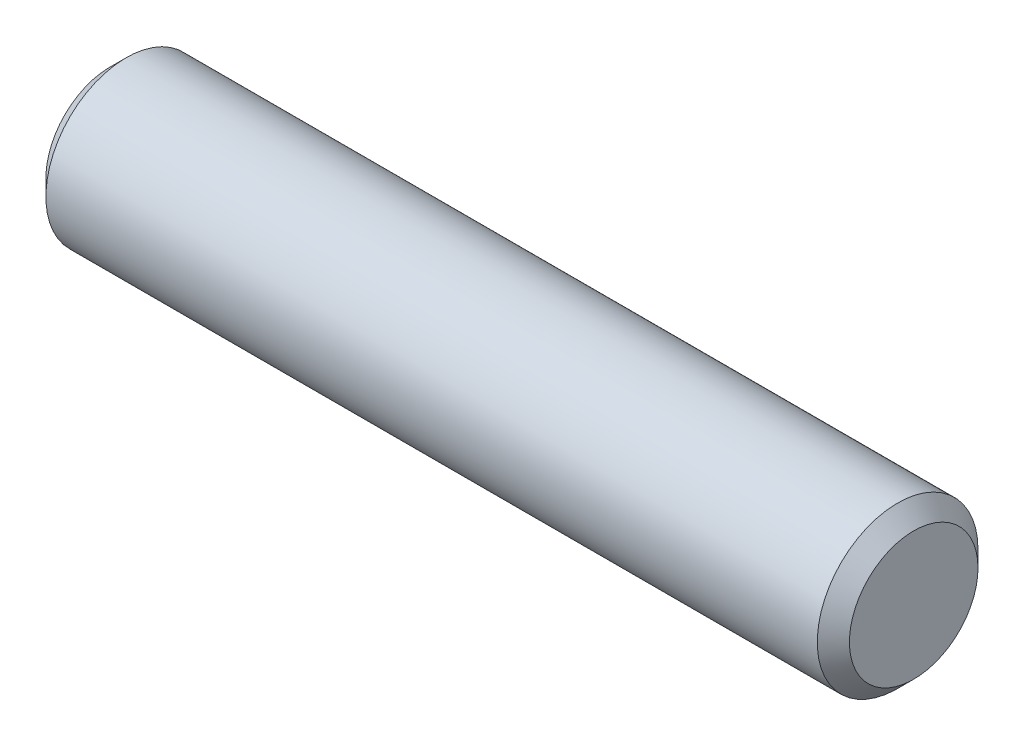
ISO-10303-21;
HEADER;
FILE_DESCRIPTION(('STEP AP214'),'2;1');
FILE_NAME('part.step','',(''),(''),'','','');
FILE_SCHEMA(('AUTOMOTIVE_DESIGN { 1 0 10303 214 1 1 1 1 }'));
ENDSEC;
DATA;
#1=APPLICATION_CONTEXT('core data for automotive mechanical design processes');
#2=APPLICATION_PROTOCOL_DEFINITION('international standard','automotive_design',2000,#1);
#3=PRODUCT_CONTEXT('',#1,'mechanical');
#4=PRODUCT('Part','Part','',(#3));
#5=PRODUCT_RELATED_PRODUCT_CATEGORY('part','',(#4));
#6=PRODUCT_DEFINITION_FORMATION('','',#4);
#7=PRODUCT_DEFINITION_CONTEXT('part definition',#1,'design');
#8=PRODUCT_DEFINITION('design','',#6,#7);
#9=PRODUCT_DEFINITION_SHAPE('','',#8);
#10=(LENGTH_UNIT() NAMED_UNIT(*) SI_UNIT(.MILLI.,.METRE.));
#11=(NAMED_UNIT(*) PLANE_ANGLE_UNIT() SI_UNIT($,.RADIAN.));
#12=(NAMED_UNIT(*) SI_UNIT($,.STERADIAN.) SOLID_ANGLE_UNIT());
#13=UNCERTAINTY_MEASURE_WITH_UNIT(LENGTH_MEASURE(1.E-05),#10,'distance_accuracy_value','');
#14=(GEOMETRIC_REPRESENTATION_CONTEXT(3) GLOBAL_UNCERTAINTY_ASSIGNED_CONTEXT((#13)) GLOBAL_UNIT_ASSIGNED_CONTEXT((#10,
#11,#12)) REPRESENTATION_CONTEXT('',''));
#15=CARTESIAN_POINT('',(0.,0.,0.));
#16=DIRECTION('',(0.,0.,1.));
#17=DIRECTION('',(1.,0.,0.));
#18=AXIS2_PLACEMENT_3D('',#15,#16,#17);
#19=CARTESIAN_POINT('',(-15.875,0.,0.));
#20=DIRECTION('',(1.,0.,0.));
#21=DIRECTION('',(0.,0.,-1.));
#22=AXIS2_PLACEMENT_3D('',#19,#20,#21);
#23=CYLINDRICAL_SURFACE('',#22,3.175);
#24=CARTESIAN_POINT('',(15.24,0.,0.));
#25=DIRECTION('',(1.,0.,0.));
#26=DIRECTION('',(0.,0.,-1.));
#27=AXIS2_PLACEMENT_3D('',#24,#25,#26);
#28=CIRCLE('',#27,3.175);
#29=CARTESIAN_POINT('',(15.24,0.,-3.175));
#30=VERTEX_POINT('',#29);
#31=EDGE_CURVE('E47',#30,#30,#28,.F.);
#32=ORIENTED_EDGE('',*,*,#31,.T.);
#33=EDGE_LOOP('',(#32));
#34=FACE_BOUND('',#33,.T.);
#35=CARTESIAN_POINT('',(-15.24,0.,0.));
#36=DIRECTION('',(1.,0.,0.));
#37=DIRECTION('',(0.,0.,-1.));
#38=AXIS2_PLACEMENT_3D('',#35,#36,#37);
#39=CIRCLE('',#38,3.175);
#40=CARTESIAN_POINT('',(-15.24,0.,-3.175));
#41=VERTEX_POINT('',#40);
#42=EDGE_CURVE('E54',#41,#41,#39,.T.);
#43=ORIENTED_EDGE('',*,*,#42,.T.);
#44=EDGE_LOOP('',(#43));
#45=FACE_BOUND('',#44,.T.);
#46=ADVANCED_FACE('F39',(#34,#45),#23,.T.);
#47=CARTESIAN_POINT('',(-15.875,0.,0.));
#48=DIRECTION('',(1.,0.,0.));
#49=DIRECTION('',(0.,0.,-1.));
#50=AXIS2_PLACEMENT_3D('',#47,#48,#49);
#51=PLANE('',#50);
#52=CARTESIAN_POINT('',(-15.875,0.,0.));
#53=DIRECTION('',(1.,0.,0.));
#54=DIRECTION('',(0.,0.,-1.));
#55=AXIS2_PLACEMENT_3D('',#52,#53,#54);
#56=CIRCLE('',#55,2.54);
#57=CARTESIAN_POINT('',(-15.875,0.,-2.54));
#58=VERTEX_POINT('',#57);
#59=EDGE_CURVE('E10',#58,#58,#56,.F.);
#60=ORIENTED_EDGE('',*,*,#59,.T.);
#61=EDGE_LOOP('',(#60));
#62=FACE_BOUND('',#61,.T.);
#63=ADVANCED_FACE('F74',(#62),#51,.F.);
#64=CARTESIAN_POINT('',(15.875,0.,0.));
#65=DIRECTION('',(1.,0.,0.));
#66=DIRECTION('',(0.,0.,-1.));
#67=AXIS2_PLACEMENT_3D('',#64,#65,#66);
#68=PLANE('',#67);
#69=CARTESIAN_POINT('',(15.875,0.,0.));
#70=DIRECTION('',(1.,0.,0.));
#71=DIRECTION('',(0.,0.,-1.));
#72=AXIS2_PLACEMENT_3D('',#69,#70,#71);
#73=CIRCLE('',#72,2.54);
#74=CARTESIAN_POINT('',(15.875,0.,-2.54));
#75=VERTEX_POINT('',#74);
#76=EDGE_CURVE('E58',#75,#75,#73,.T.);
#77=ORIENTED_EDGE('',*,*,#76,.T.);
#78=EDGE_LOOP('',(#77));
#79=FACE_BOUND('',#78,.T.);
#80=ADVANCED_FACE('F64',(#79),#68,.T.);
#81=CARTESIAN_POINT('',(15.875,0.,0.));
#82=DIRECTION('',(-1.,0.,0.));
#83=DIRECTION('',(0.,0.,1.));
#84=AXIS2_PLACEMENT_3D('',#81,#82,#83);
#85=CONICAL_SURFACE('',#84,2.54,0.785398163397445);
#86=ORIENTED_EDGE('',*,*,#31,.F.);
#87=EDGE_LOOP('',(#86));
#88=FACE_BOUND('',#87,.T.);
#89=ORIENTED_EDGE('',*,*,#76,.F.);
#90=EDGE_LOOP('',(#89));
#91=FACE_BOUND('',#90,.T.);
#92=ADVANCED_FACE('F66',(#88,#91),#85,.T.);
#93=CARTESIAN_POINT('',(-15.24,0.,0.));
#94=DIRECTION('',(1.,0.,0.));
#95=DIRECTION('',(0.,0.,-1.));
#96=AXIS2_PLACEMENT_3D('',#93,#94,#95);
#97=CONICAL_SURFACE('',#96,3.175,0.78539816339745);
#98=ORIENTED_EDGE('',*,*,#59,.F.);
#99=EDGE_LOOP('',(#98));
#100=FACE_BOUND('',#99,.T.);
#101=ORIENTED_EDGE('',*,*,#42,.F.);
#102=EDGE_LOOP('',(#101));
#103=FACE_BOUND('',#102,.T.);
#104=ADVANCED_FACE('F41',(#100,#103),#97,.T.);
#105=CLOSED_SHELL('',(#46,#63,#80,#92,#104));
#106=MANIFOLD_SOLID_BREP('B2',#105);
#107=ADVANCED_BREP_SHAPE_REPRESENTATION('',(#18,#106),#14);
#108=SHAPE_DEFINITION_REPRESENTATION(#9,#107);
ENDSEC;
END-ISO-10303-21;
